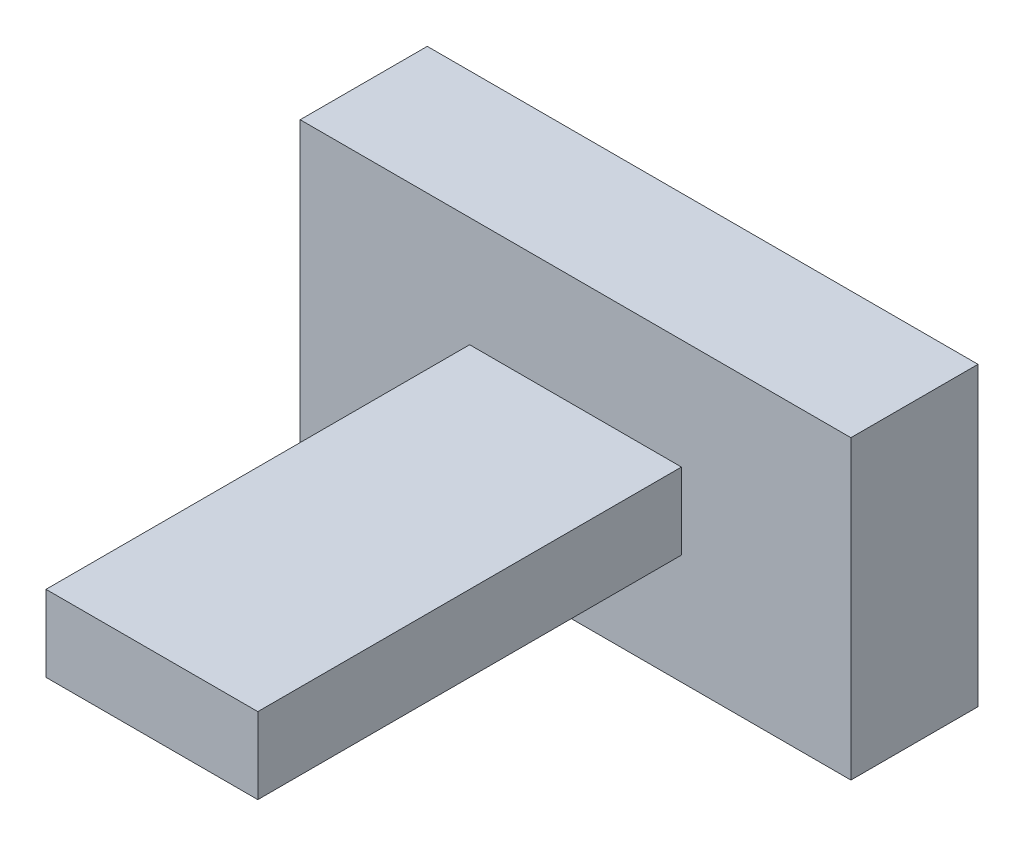
ISO-10303-21;
HEADER;
FILE_DESCRIPTION(('STEP AP214'),'2;1');
FILE_NAME('part.step','',(''),(''),'','','');
FILE_SCHEMA(('AUTOMOTIVE_DESIGN { 1 0 10303 214 1 1 1 1 }'));
ENDSEC;
DATA;
#1=APPLICATION_CONTEXT('core data for automotive mechanical design processes');
#2=APPLICATION_PROTOCOL_DEFINITION('international standard','automotive_design',2000,#1);
#3=PRODUCT_CONTEXT('',#1,'mechanical');
#4=PRODUCT('Part','Part','',(#3));
#5=PRODUCT_RELATED_PRODUCT_CATEGORY('part','',(#4));
#6=PRODUCT_DEFINITION_FORMATION('','',#4);
#7=PRODUCT_DEFINITION_CONTEXT('part definition',#1,'design');
#8=PRODUCT_DEFINITION('design','',#6,#7);
#9=PRODUCT_DEFINITION_SHAPE('','',#8);
#10=(LENGTH_UNIT() NAMED_UNIT(*) SI_UNIT(.MILLI.,.METRE.));
#11=(NAMED_UNIT(*) PLANE_ANGLE_UNIT() SI_UNIT($,.RADIAN.));
#12=(NAMED_UNIT(*) SI_UNIT($,.STERADIAN.) SOLID_ANGLE_UNIT());
#13=UNCERTAINTY_MEASURE_WITH_UNIT(LENGTH_MEASURE(1.E-05),#10,'distance_accuracy_value','');
#14=(GEOMETRIC_REPRESENTATION_CONTEXT(3) GLOBAL_UNCERTAINTY_ASSIGNED_CONTEXT((#13)) GLOBAL_UNIT_ASSIGNED_CONTEXT((#10,
#11,#12)) REPRESENTATION_CONTEXT('',''));
#15=CARTESIAN_POINT('',(0.,0.,0.));
#16=DIRECTION('',(0.,0.,1.));
#17=DIRECTION('',(1.,0.,0.));
#18=AXIS2_PLACEMENT_3D('',#15,#16,#17);
#19=CARTESIAN_POINT('',(0.,0.,3.));
#20=DIRECTION('',(0.,0.,-1.));
#21=DIRECTION('',(-1.,0.,0.));
#22=AXIS2_PLACEMENT_3D('',#19,#20,#21);
#23=PLANE('',#22);
#24=DIRECTION('',(0.,-1.,0.));
#25=VECTOR('',#24,1.);
#26=CARTESIAN_POINT('',(0.,0.,3.));
#27=LINE('',#26,#25);
#28=CARTESIAN_POINT('',(0.,7.,3.));
#29=VERTEX_POINT('',#28);
#30=CARTESIAN_POINT('',(0.,0.,3.));
#31=VERTEX_POINT('',#30);
#32=EDGE_CURVE('E137',#29,#31,#27,.T.);
#33=ORIENTED_EDGE('',*,*,#32,.T.);
#34=DIRECTION('',(1.,0.,0.));
#35=VECTOR('',#34,1.);
#36=CARTESIAN_POINT('',(0.,0.,3.));
#37=LINE('',#36,#35);
#38=CARTESIAN_POINT('',(13.,0.,3.));
#39=VERTEX_POINT('',#38);
#40=EDGE_CURVE('E140',#31,#39,#37,.T.);
#41=ORIENTED_EDGE('',*,*,#40,.T.);
#42=DIRECTION('',(0.,1.,0.));
#43=VECTOR('',#42,1.);
#44=CARTESIAN_POINT('',(13.,0.,3.));
#45=LINE('',#44,#43);
#46=CARTESIAN_POINT('',(13.,7.,3.));
#47=VERTEX_POINT('',#46);
#48=EDGE_CURVE('E143',#39,#47,#45,.T.);
#49=ORIENTED_EDGE('',*,*,#48,.T.);
#50=DIRECTION('',(-1.,0.,0.));
#51=VECTOR('',#50,1.);
#52=CARTESIAN_POINT('',(0.,7.,3.));
#53=LINE('',#52,#51);
#54=EDGE_CURVE('E145',#47,#29,#53,.T.);
#55=ORIENTED_EDGE('',*,*,#54,.T.);
#56=EDGE_LOOP('',(#33,#41,#49,#55));
#57=FACE_BOUND('',#56,.T.);
#58=DIRECTION('',(0.,-1.,0.));
#59=VECTOR('',#58,1.);
#60=CARTESIAN_POINT('',(4.,4.4,3.));
#61=LINE('',#60,#59);
#62=CARTESIAN_POINT('',(4.,4.4,3.));
#63=VERTEX_POINT('',#62);
#64=CARTESIAN_POINT('',(4.,2.6,3.));
#65=VERTEX_POINT('',#64);
#66=EDGE_CURVE('E58',#63,#65,#61,.T.);
#67=ORIENTED_EDGE('',*,*,#66,.F.);
#68=DIRECTION('',(-1.,0.,0.));
#69=VECTOR('',#68,1.);
#70=CARTESIAN_POINT('',(4.,4.4,3.));
#71=LINE('',#70,#69);
#72=CARTESIAN_POINT('',(9.,4.4,3.));
#73=VERTEX_POINT('',#72);
#74=EDGE_CURVE('E62',#73,#63,#71,.T.);
#75=ORIENTED_EDGE('',*,*,#74,.F.);
#76=DIRECTION('',(0.,1.,0.));
#77=VECTOR('',#76,1.);
#78=CARTESIAN_POINT('',(9.,4.4,3.));
#79=LINE('',#78,#77);
#80=CARTESIAN_POINT('',(9.,2.6,3.));
#81=VERTEX_POINT('',#80);
#82=EDGE_CURVE('E260',#81,#73,#79,.T.);
#83=ORIENTED_EDGE('',*,*,#82,.F.);
#84=DIRECTION('',(1.,0.,0.));
#85=VECTOR('',#84,1.);
#86=CARTESIAN_POINT('',(4.,2.6,3.));
#87=LINE('',#86,#85);
#88=EDGE_CURVE('E266',#65,#81,#87,.T.);
#89=ORIENTED_EDGE('',*,*,#88,.F.);
#90=EDGE_LOOP('',(#67,#75,#83,#89));
#91=FACE_BOUND('',#90,.T.);
#92=ADVANCED_FACE('F43',(#57,#91),#23,.F.);
#93=CARTESIAN_POINT('',(0.,0.,3.));
#94=DIRECTION('',(1.,0.,0.));
#95=DIRECTION('',(0.,0.,-1.));
#96=AXIS2_PLACEMENT_3D('',#93,#94,#95);
#97=PLANE('',#96);
#98=DIRECTION('',(0.,-1.,0.));
#99=VECTOR('',#98,1.);
#100=CARTESIAN_POINT('',(0.,0.,0.));
#101=LINE('',#100,#99);
#102=CARTESIAN_POINT('',(0.,7.,0.));
#103=VERTEX_POINT('',#102);
#104=CARTESIAN_POINT('',(0.,0.,0.));
#105=VERTEX_POINT('',#104);
#106=EDGE_CURVE('E128',#103,#105,#101,.T.);
#107=ORIENTED_EDGE('',*,*,#106,.T.);
#108=DIRECTION('',(0.,0.,-1.));
#109=VECTOR('',#108,1.);
#110=CARTESIAN_POINT('',(0.,0.,3.));
#111=LINE('',#110,#109);
#112=EDGE_CURVE('E11',#31,#105,#111,.T.);
#113=ORIENTED_EDGE('',*,*,#112,.F.);
#114=ORIENTED_EDGE('',*,*,#32,.F.);
#115=DIRECTION('',(0.,0.,-1.));
#116=VECTOR('',#115,1.);
#117=CARTESIAN_POINT('',(0.,7.,3.));
#118=LINE('',#117,#116);
#119=EDGE_CURVE('E146',#29,#103,#118,.T.);
#120=ORIENTED_EDGE('',*,*,#119,.T.);
#121=EDGE_LOOP('',(#107,#113,#114,#120));
#122=FACE_BOUND('',#121,.T.);
#123=ADVANCED_FACE('F45',(#122),#97,.F.);
#124=CARTESIAN_POINT('',(0.,0.,3.));
#125=DIRECTION('',(0.,1.,0.));
#126=DIRECTION('',(0.,0.,1.));
#127=AXIS2_PLACEMENT_3D('',#124,#125,#126);
#128=PLANE('',#127);
#129=DIRECTION('',(1.,0.,0.));
#130=VECTOR('',#129,1.);
#131=CARTESIAN_POINT('',(0.,0.,0.));
#132=LINE('',#131,#130);
#133=CARTESIAN_POINT('',(13.,0.,0.));
#134=VERTEX_POINT('',#133);
#135=EDGE_CURVE('E131',#105,#134,#132,.T.);
#136=ORIENTED_EDGE('',*,*,#135,.T.);
#137=DIRECTION('',(0.,0.,-1.));
#138=VECTOR('',#137,1.);
#139=CARTESIAN_POINT('',(13.,0.,3.));
#140=LINE('',#139,#138);
#141=EDGE_CURVE('E51',#39,#134,#140,.T.);
#142=ORIENTED_EDGE('',*,*,#141,.F.);
#143=ORIENTED_EDGE('',*,*,#40,.F.);
#144=ORIENTED_EDGE('',*,*,#112,.T.);
#145=EDGE_LOOP('',(#136,#142,#143,#144));
#146=FACE_BOUND('',#145,.T.);
#147=ADVANCED_FACE('F176',(#146),#128,.F.);
#148=CARTESIAN_POINT('',(13.,0.,3.));
#149=DIRECTION('',(-1.,0.,0.));
#150=DIRECTION('',(0.,0.,1.));
#151=AXIS2_PLACEMENT_3D('',#148,#149,#150);
#152=PLANE('',#151);
#153=DIRECTION('',(0.,1.,0.));
#154=VECTOR('',#153,1.);
#155=CARTESIAN_POINT('',(13.,0.,0.));
#156=LINE('',#155,#154);
#157=CARTESIAN_POINT('',(13.,7.,0.));
#158=VERTEX_POINT('',#157);
#159=EDGE_CURVE('E149',#134,#158,#156,.T.);
#160=ORIENTED_EDGE('',*,*,#159,.T.);
#161=DIRECTION('',(0.,0.,-1.));
#162=VECTOR('',#161,1.);
#163=CARTESIAN_POINT('',(13.,7.,3.));
#164=LINE('',#163,#162);
#165=EDGE_CURVE('E154',#47,#158,#164,.T.);
#166=ORIENTED_EDGE('',*,*,#165,.F.);
#167=ORIENTED_EDGE('',*,*,#48,.F.);
#168=ORIENTED_EDGE('',*,*,#141,.T.);
#169=EDGE_LOOP('',(#160,#166,#167,#168));
#170=FACE_BOUND('',#169,.T.);
#171=ADVANCED_FACE('F161',(#170),#152,.F.);
#172=CARTESIAN_POINT('',(0.,7.,3.));
#173=DIRECTION('',(0.,-1.,0.));
#174=DIRECTION('',(0.,0.,-1.));
#175=AXIS2_PLACEMENT_3D('',#172,#173,#174);
#176=PLANE('',#175);
#177=DIRECTION('',(-1.,0.,0.));
#178=VECTOR('',#177,1.);
#179=CARTESIAN_POINT('',(0.,7.,0.));
#180=LINE('',#179,#178);
#181=EDGE_CURVE('E141',#158,#103,#180,.T.);
#182=ORIENTED_EDGE('',*,*,#181,.T.);
#183=ORIENTED_EDGE('',*,*,#119,.F.);
#184=ORIENTED_EDGE('',*,*,#54,.F.);
#185=ORIENTED_EDGE('',*,*,#165,.T.);
#186=EDGE_LOOP('',(#182,#183,#184,#185));
#187=FACE_BOUND('',#186,.T.);
#188=ADVANCED_FACE('F170',(#187),#176,.F.);
#189=CARTESIAN_POINT('',(0.,0.,0.));
#190=DIRECTION('',(0.,0.,-1.));
#191=DIRECTION('',(-1.,0.,0.));
#192=AXIS2_PLACEMENT_3D('',#189,#190,#191);
#193=PLANE('',#192);
#194=ORIENTED_EDGE('',*,*,#106,.F.);
#195=ORIENTED_EDGE('',*,*,#181,.F.);
#196=ORIENTED_EDGE('',*,*,#159,.F.);
#197=ORIENTED_EDGE('',*,*,#135,.F.);
#198=EDGE_LOOP('',(#194,#195,#196,#197));
#199=FACE_BOUND('',#198,.T.);
#200=ADVANCED_FACE('F167',(#199),#193,.T.);
#201=CARTESIAN_POINT('',(4.,4.4,13.));
#202=DIRECTION('',(1.,0.,0.));
#203=DIRECTION('',(0.,0.,-1.));
#204=AXIS2_PLACEMENT_3D('',#201,#202,#203);
#205=PLANE('',#204);
#206=ORIENTED_EDGE('',*,*,#66,.T.);
#207=DIRECTION('',(0.,0.,-1.));
#208=VECTOR('',#207,1.);
#209=CARTESIAN_POINT('',(4.,2.6,13.));
#210=LINE('',#209,#208);
#211=CARTESIAN_POINT('',(4.,2.6,13.));
#212=VERTEX_POINT('',#211);
#213=EDGE_CURVE('E111',#212,#65,#210,.T.);
#214=ORIENTED_EDGE('',*,*,#213,.F.);
#215=DIRECTION('',(0.,-1.,0.));
#216=VECTOR('',#215,1.);
#217=CARTESIAN_POINT('',(4.,4.4,13.));
#218=LINE('',#217,#216);
#219=CARTESIAN_POINT('',(4.,4.4,13.));
#220=VERTEX_POINT('',#219);
#221=EDGE_CURVE('E117',#220,#212,#218,.T.);
#222=ORIENTED_EDGE('',*,*,#221,.F.);
#223=DIRECTION('',(0.,0.,-1.));
#224=VECTOR('',#223,1.);
#225=CARTESIAN_POINT('',(4.,4.4,13.));
#226=LINE('',#225,#224);
#227=EDGE_CURVE('E258',#220,#63,#226,.T.);
#228=ORIENTED_EDGE('',*,*,#227,.T.);
#229=EDGE_LOOP('',(#206,#214,#222,#228));
#230=FACE_BOUND('',#229,.T.);
#231=ADVANCED_FACE('F127',(#230),#205,.F.);
#232=CARTESIAN_POINT('',(4.,2.6,13.));
#233=DIRECTION('',(0.,1.,0.));
#234=DIRECTION('',(0.,0.,1.));
#235=AXIS2_PLACEMENT_3D('',#232,#233,#234);
#236=PLANE('',#235);
#237=ORIENTED_EDGE('',*,*,#88,.T.);
#238=DIRECTION('',(0.,0.,-1.));
#239=VECTOR('',#238,1.);
#240=CARTESIAN_POINT('',(9.,2.6,13.));
#241=LINE('',#240,#239);
#242=CARTESIAN_POINT('',(9.,2.6,13.));
#243=VERTEX_POINT('',#242);
#244=EDGE_CURVE('E113',#243,#81,#241,.T.);
#245=ORIENTED_EDGE('',*,*,#244,.F.);
#246=DIRECTION('',(1.,0.,0.));
#247=VECTOR('',#246,1.);
#248=CARTESIAN_POINT('',(4.,2.6,13.));
#249=LINE('',#248,#247);
#250=EDGE_CURVE('E106',#212,#243,#249,.T.);
#251=ORIENTED_EDGE('',*,*,#250,.F.);
#252=ORIENTED_EDGE('',*,*,#213,.T.);
#253=EDGE_LOOP('',(#237,#245,#251,#252));
#254=FACE_BOUND('',#253,.T.);
#255=ADVANCED_FACE('F109',(#254),#236,.F.);
#256=CARTESIAN_POINT('',(9.,4.4,13.));
#257=DIRECTION('',(-1.,0.,0.));
#258=DIRECTION('',(0.,-1.,0.));
#259=AXIS2_PLACEMENT_3D('',#256,#257,#258);
#260=PLANE('',#259);
#261=ORIENTED_EDGE('',*,*,#82,.T.);
#262=DIRECTION('',(0.,0.,-1.));
#263=VECTOR('',#262,1.);
#264=CARTESIAN_POINT('',(9.,4.4,13.));
#265=LINE('',#264,#263);
#266=CARTESIAN_POINT('',(9.,4.4,13.));
#267=VERTEX_POINT('',#266);
#268=EDGE_CURVE('E133',#267,#73,#265,.T.);
#269=ORIENTED_EDGE('',*,*,#268,.F.);
#270=DIRECTION('',(0.,1.,0.));
#271=VECTOR('',#270,1.);
#272=CARTESIAN_POINT('',(9.,4.4,13.));
#273=LINE('',#272,#271);
#274=EDGE_CURVE('E116',#243,#267,#273,.T.);
#275=ORIENTED_EDGE('',*,*,#274,.F.);
#276=ORIENTED_EDGE('',*,*,#244,.T.);
#277=EDGE_LOOP('',(#261,#269,#275,#276));
#278=FACE_BOUND('',#277,.T.);
#279=ADVANCED_FACE('F218',(#278),#260,.F.);
#280=CARTESIAN_POINT('',(4.,4.4,13.));
#281=DIRECTION('',(0.,-1.,0.));
#282=DIRECTION('',(1.,0.,0.));
#283=AXIS2_PLACEMENT_3D('',#280,#281,#282);
#284=PLANE('',#283);
#285=ORIENTED_EDGE('',*,*,#74,.T.);
#286=ORIENTED_EDGE('',*,*,#227,.F.);
#287=DIRECTION('',(-1.,0.,0.));
#288=VECTOR('',#287,1.);
#289=CARTESIAN_POINT('',(4.,4.4,13.));
#290=LINE('',#289,#288);
#291=EDGE_CURVE('E122',#267,#220,#290,.T.);
#292=ORIENTED_EDGE('',*,*,#291,.F.);
#293=ORIENTED_EDGE('',*,*,#268,.T.);
#294=EDGE_LOOP('',(#285,#286,#292,#293));
#295=FACE_BOUND('',#294,.T.);
#296=ADVANCED_FACE('F226',(#295),#284,.F.);
#297=CARTESIAN_POINT('',(0.,0.,13.));
#298=DIRECTION('',(0.,0.,1.));
#299=DIRECTION('',(1.,0.,0.));
#300=AXIS2_PLACEMENT_3D('',#297,#298,#299);
#301=PLANE('',#300);
#302=ORIENTED_EDGE('',*,*,#221,.T.);
#303=ORIENTED_EDGE('',*,*,#250,.T.);
#304=ORIENTED_EDGE('',*,*,#274,.T.);
#305=ORIENTED_EDGE('',*,*,#291,.T.);
#306=EDGE_LOOP('',(#302,#303,#304,#305));
#307=FACE_BOUND('',#306,.T.);
#308=ADVANCED_FACE('F120',(#307),#301,.T.);
#309=CLOSED_SHELL('',(#92,#123,#147,#171,#188,#200,#231,#255,#279,#296,#308));
#310=MANIFOLD_SOLID_BREP('B2',#309);
#311=ADVANCED_BREP_SHAPE_REPRESENTATION('',(#18,#310),#14);
#312=SHAPE_DEFINITION_REPRESENTATION(#9,#311);
ENDSEC;
END-ISO-10303-21;
